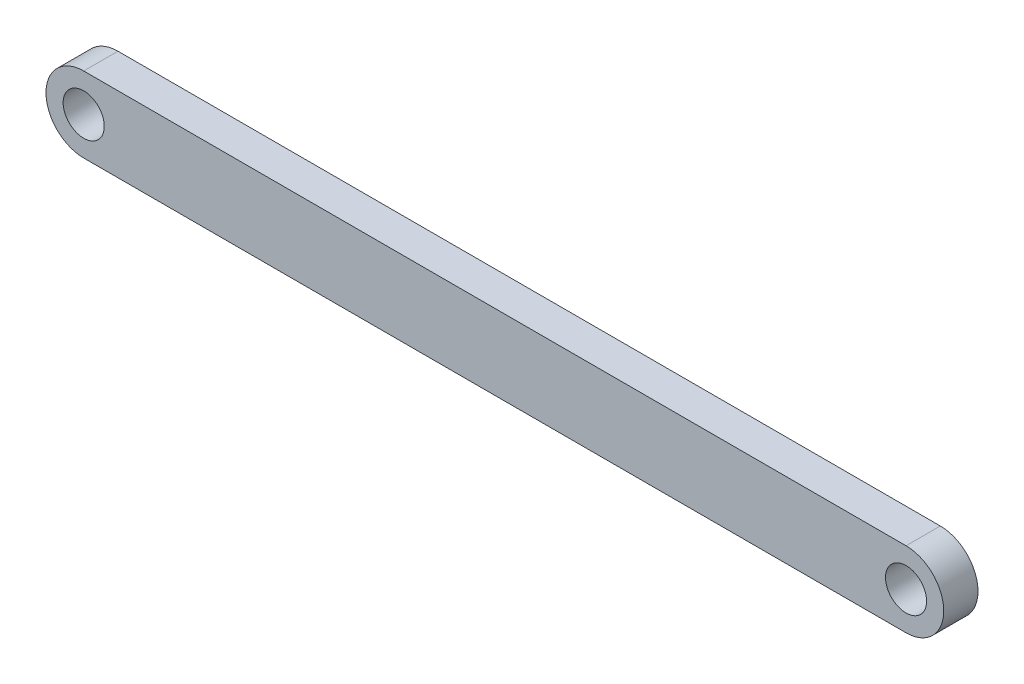
ISO-10303-21;
HEADER;
FILE_DESCRIPTION(('STEP AP214'),'2;1');
FILE_NAME('part.step','',(''),(''),'','','');
FILE_SCHEMA(('AUTOMOTIVE_DESIGN { 1 0 10303 214 1 1 1 1 }'));
ENDSEC;
DATA;
#1=APPLICATION_CONTEXT('core data for automotive mechanical design processes');
#2=APPLICATION_PROTOCOL_DEFINITION('international standard','automotive_design',2000,#1);
#3=PRODUCT_CONTEXT('',#1,'mechanical');
#4=PRODUCT('Part','Part','',(#3));
#5=PRODUCT_RELATED_PRODUCT_CATEGORY('part','',(#4));
#6=PRODUCT_DEFINITION_FORMATION('','',#4);
#7=PRODUCT_DEFINITION_CONTEXT('part definition',#1,'design');
#8=PRODUCT_DEFINITION('design','',#6,#7);
#9=PRODUCT_DEFINITION_SHAPE('','',#8);
#10=(LENGTH_UNIT() NAMED_UNIT(*) SI_UNIT(.MILLI.,.METRE.));
#11=(NAMED_UNIT(*) PLANE_ANGLE_UNIT() SI_UNIT($,.RADIAN.));
#12=(NAMED_UNIT(*) SI_UNIT($,.STERADIAN.) SOLID_ANGLE_UNIT());
#13=UNCERTAINTY_MEASURE_WITH_UNIT(LENGTH_MEASURE(1.E-05),#10,'distance_accuracy_value','');
#14=(GEOMETRIC_REPRESENTATION_CONTEXT(3) GLOBAL_UNCERTAINTY_ASSIGNED_CONTEXT((#13)) GLOBAL_UNIT_ASSIGNED_CONTEXT((#10,
#11,#12)) REPRESENTATION_CONTEXT('',''));
#15=CARTESIAN_POINT('',(0.,0.,0.));
#16=DIRECTION('',(0.,0.,1.));
#17=DIRECTION('',(1.,0.,0.));
#18=AXIS2_PLACEMENT_3D('',#15,#16,#17);
#19=CARTESIAN_POINT('',(-60.,0.,2.5));
#20=DIRECTION('',(0.,0.,1.));
#21=DIRECTION('',(1.,0.,0.));
#22=AXIS2_PLACEMENT_3D('',#19,#20,#21);
#23=PLANE('',#22);
#24=CARTESIAN_POINT('',(-60.,0.,2.5));
#25=DIRECTION('',(0.,0.,1.));
#26=DIRECTION('',(1.,0.,0.));
#27=AXIS2_PLACEMENT_3D('',#24,#25,#26);
#28=CIRCLE('',#27,3.);
#29=CARTESIAN_POINT('',(-57.,0.,2.5));
#30=VERTEX_POINT('',#29);
#31=EDGE_CURVE('E103',#30,#30,#28,.T.);
#32=ORIENTED_EDGE('',*,*,#31,.F.);
#33=EDGE_LOOP('',(#32));
#34=FACE_BOUND('',#33,.T.);
#35=CARTESIAN_POINT('',(-60.,0.,2.5));
#36=DIRECTION('',(0.,0.,1.));
#37=DIRECTION('',(1.,0.,0.));
#38=AXIS2_PLACEMENT_3D('',#35,#36,#37);
#39=CIRCLE('',#38,5.5);
#40=CARTESIAN_POINT('',(-60.,5.5,2.5));
#41=VERTEX_POINT('',#40);
#42=CARTESIAN_POINT('',(-60.,-5.5,2.5));
#43=VERTEX_POINT('',#42);
#44=EDGE_CURVE('E88',#41,#43,#39,.T.);
#45=ORIENTED_EDGE('',*,*,#44,.T.);
#46=DIRECTION('',(1.,0.,0.));
#47=VECTOR('',#46,1.);
#48=CARTESIAN_POINT('',(-60.,-5.5,2.5));
#49=LINE('',#48,#47);
#50=CARTESIAN_POINT('',(60.,-5.5,2.5));
#51=VERTEX_POINT('',#50);
#52=EDGE_CURVE('E83',#43,#51,#49,.T.);
#53=ORIENTED_EDGE('',*,*,#52,.T.);
#54=CARTESIAN_POINT('',(60.,0.,2.5));
#55=DIRECTION('',(0.,0.,1.));
#56=DIRECTION('',(1.,0.,0.));
#57=AXIS2_PLACEMENT_3D('',#54,#55,#56);
#58=CIRCLE('',#57,5.5);
#59=CARTESIAN_POINT('',(60.,5.5,2.5));
#60=VERTEX_POINT('',#59);
#61=EDGE_CURVE('E86',#51,#60,#58,.T.);
#62=ORIENTED_EDGE('',*,*,#61,.T.);
#63=DIRECTION('',(-1.,0.,0.));
#64=VECTOR('',#63,1.);
#65=CARTESIAN_POINT('',(-60.,5.5,2.5));
#66=LINE('',#65,#64);
#67=EDGE_CURVE('E53',#60,#41,#66,.T.);
#68=ORIENTED_EDGE('',*,*,#67,.T.);
#69=EDGE_LOOP('',(#45,#53,#62,#68));
#70=FACE_BOUND('',#69,.T.);
#71=CARTESIAN_POINT('',(60.,0.,2.5));
#72=DIRECTION('',(0.,0.,1.));
#73=DIRECTION('',(1.,0.,0.));
#74=AXIS2_PLACEMENT_3D('',#71,#72,#73);
#75=CIRCLE('',#74,3.00000000000001);
#76=CARTESIAN_POINT('',(63.,0.,2.5));
#77=VERTEX_POINT('',#76);
#78=EDGE_CURVE('E118',#77,#77,#75,.T.);
#79=ORIENTED_EDGE('',*,*,#78,.F.);
#80=EDGE_LOOP('',(#79));
#81=FACE_BOUND('',#80,.T.);
#82=ADVANCED_FACE('F36',(#34,#70,#81),#23,.T.);
#83=CARTESIAN_POINT('',(-60.,0.,-2.5));
#84=DIRECTION('',(0.,0.,1.));
#85=DIRECTION('',(1.,0.,0.));
#86=AXIS2_PLACEMENT_3D('',#83,#84,#85);
#87=PLANE('',#86);
#88=CARTESIAN_POINT('',(-60.,0.,-2.5));
#89=DIRECTION('',(0.,0.,1.));
#90=DIRECTION('',(1.,0.,0.));
#91=AXIS2_PLACEMENT_3D('',#88,#89,#90);
#92=CIRCLE('',#91,5.5);
#93=CARTESIAN_POINT('',(-60.,5.5,-2.5));
#94=VERTEX_POINT('',#93);
#95=CARTESIAN_POINT('',(-60.,-5.5,-2.5));
#96=VERTEX_POINT('',#95);
#97=EDGE_CURVE('E100',#94,#96,#92,.T.);
#98=ORIENTED_EDGE('',*,*,#97,.F.);
#99=DIRECTION('',(-1.,0.,0.));
#100=VECTOR('',#99,1.);
#101=CARTESIAN_POINT('',(-60.,5.5,-2.5));
#102=LINE('',#101,#100);
#103=CARTESIAN_POINT('',(60.,5.5,-2.5));
#104=VERTEX_POINT('',#103);
#105=EDGE_CURVE('E76',#104,#94,#102,.T.);
#106=ORIENTED_EDGE('',*,*,#105,.F.);
#107=CARTESIAN_POINT('',(60.,0.,-2.5));
#108=DIRECTION('',(0.,0.,1.));
#109=DIRECTION('',(1.,0.,0.));
#110=AXIS2_PLACEMENT_3D('',#107,#108,#109);
#111=CIRCLE('',#110,5.5);
#112=CARTESIAN_POINT('',(60.,-5.5,-2.5));
#113=VERTEX_POINT('',#112);
#114=EDGE_CURVE('E70',#113,#104,#111,.T.);
#115=ORIENTED_EDGE('',*,*,#114,.F.);
#116=DIRECTION('',(1.,0.,0.));
#117=VECTOR('',#116,1.);
#118=CARTESIAN_POINT('',(-60.,-5.5,-2.5));
#119=LINE('',#118,#117);
#120=EDGE_CURVE('E92',#96,#113,#119,.T.);
#121=ORIENTED_EDGE('',*,*,#120,.F.);
#122=EDGE_LOOP('',(#98,#106,#115,#121));
#123=FACE_BOUND('',#122,.T.);
#124=CARTESIAN_POINT('',(-60.,0.,-2.5));
#125=DIRECTION('',(0.,0.,1.));
#126=DIRECTION('',(1.,0.,0.));
#127=AXIS2_PLACEMENT_3D('',#124,#125,#126);
#128=CIRCLE('',#127,3.);
#129=CARTESIAN_POINT('',(-57.,0.,-2.5));
#130=VERTEX_POINT('',#129);
#131=EDGE_CURVE('E115',#130,#130,#128,.T.);
#132=ORIENTED_EDGE('',*,*,#131,.T.);
#133=EDGE_LOOP('',(#132));
#134=FACE_BOUND('',#133,.T.);
#135=CARTESIAN_POINT('',(60.,0.,-2.5));
#136=DIRECTION('',(0.,0.,1.));
#137=DIRECTION('',(1.,0.,0.));
#138=AXIS2_PLACEMENT_3D('',#135,#136,#137);
#139=CIRCLE('',#138,3.00000000000001);
#140=CARTESIAN_POINT('',(63.,0.,-2.5));
#141=VERTEX_POINT('',#140);
#142=EDGE_CURVE('E121',#141,#141,#139,.T.);
#143=ORIENTED_EDGE('',*,*,#142,.T.);
#144=EDGE_LOOP('',(#143));
#145=FACE_BOUND('',#144,.T.);
#146=ADVANCED_FACE('F111',(#123,#134,#145),#87,.F.);
#147=CARTESIAN_POINT('',(-60.,0.,2.5));
#148=DIRECTION('',(0.,0.,-1.));
#149=DIRECTION('',(-1.,0.,0.));
#150=AXIS2_PLACEMENT_3D('',#147,#148,#149);
#151=CYLINDRICAL_SURFACE('',#150,5.5);
#152=ORIENTED_EDGE('',*,*,#97,.T.);
#153=DIRECTION('',(0.,0.,-1.));
#154=VECTOR('',#153,1.);
#155=CARTESIAN_POINT('',(-60.,-5.5,2.5));
#156=LINE('',#155,#154);
#157=EDGE_CURVE('E11',#43,#96,#156,.T.);
#158=ORIENTED_EDGE('',*,*,#157,.F.);
#159=ORIENTED_EDGE('',*,*,#44,.F.);
#160=DIRECTION('',(0.,0.,-1.));
#161=VECTOR('',#160,1.);
#162=CARTESIAN_POINT('',(-60.,5.5,2.5));
#163=LINE('',#162,#161);
#164=EDGE_CURVE('E96',#41,#94,#163,.T.);
#165=ORIENTED_EDGE('',*,*,#164,.T.);
#166=EDGE_LOOP('',(#152,#158,#159,#165));
#167=FACE_BOUND('',#166,.T.);
#168=ADVANCED_FACE('F38',(#167),#151,.T.);
#169=CARTESIAN_POINT('',(-60.,-5.5,2.5));
#170=DIRECTION('',(0.,1.,0.));
#171=DIRECTION('',(0.,0.,1.));
#172=AXIS2_PLACEMENT_3D('',#169,#170,#171);
#173=PLANE('',#172);
#174=ORIENTED_EDGE('',*,*,#120,.T.);
#175=DIRECTION('',(0.,0.,-1.));
#176=VECTOR('',#175,1.);
#177=CARTESIAN_POINT('',(60.,-5.5,2.5));
#178=LINE('',#177,#176);
#179=EDGE_CURVE('E45',#51,#113,#178,.T.);
#180=ORIENTED_EDGE('',*,*,#179,.F.);
#181=ORIENTED_EDGE('',*,*,#52,.F.);
#182=ORIENTED_EDGE('',*,*,#157,.T.);
#183=EDGE_LOOP('',(#174,#180,#181,#182));
#184=FACE_BOUND('',#183,.T.);
#185=ADVANCED_FACE('F91',(#184),#173,.F.);
#186=CARTESIAN_POINT('',(60.,0.,2.5));
#187=DIRECTION('',(0.,0.,-1.));
#188=DIRECTION('',(-1.,0.,0.));
#189=AXIS2_PLACEMENT_3D('',#186,#187,#188);
#190=CYLINDRICAL_SURFACE('',#189,5.5);
#191=ORIENTED_EDGE('',*,*,#114,.T.);
#192=DIRECTION('',(0.,0.,-1.));
#193=VECTOR('',#192,1.);
#194=CARTESIAN_POINT('',(60.,5.5,2.5));
#195=LINE('',#194,#193);
#196=EDGE_CURVE('E93',#60,#104,#195,.T.);
#197=ORIENTED_EDGE('',*,*,#196,.F.);
#198=ORIENTED_EDGE('',*,*,#61,.F.);
#199=ORIENTED_EDGE('',*,*,#179,.T.);
#200=EDGE_LOOP('',(#191,#197,#198,#199));
#201=FACE_BOUND('',#200,.T.);
#202=ADVANCED_FACE('F94',(#201),#190,.T.);
#203=CARTESIAN_POINT('',(-60.,5.5,2.5));
#204=DIRECTION('',(0.,-1.,0.));
#205=DIRECTION('',(0.,0.,-1.));
#206=AXIS2_PLACEMENT_3D('',#203,#204,#205);
#207=PLANE('',#206);
#208=ORIENTED_EDGE('',*,*,#105,.T.);
#209=ORIENTED_EDGE('',*,*,#164,.F.);
#210=ORIENTED_EDGE('',*,*,#67,.F.);
#211=ORIENTED_EDGE('',*,*,#196,.T.);
#212=EDGE_LOOP('',(#208,#209,#210,#211));
#213=FACE_BOUND('',#212,.T.);
#214=ADVANCED_FACE('F108',(#213),#207,.F.);
#215=CARTESIAN_POINT('',(-60.,0.,2.5));
#216=DIRECTION('',(0.,0.,-1.));
#217=DIRECTION('',(-1.,0.,0.));
#218=AXIS2_PLACEMENT_3D('',#215,#216,#217);
#219=CYLINDRICAL_SURFACE('',#218,3.);
#220=ORIENTED_EDGE('',*,*,#31,.T.);
#221=EDGE_LOOP('',(#220));
#222=FACE_BOUND('',#221,.T.);
#223=ORIENTED_EDGE('',*,*,#131,.F.);
#224=EDGE_LOOP('',(#223));
#225=FACE_BOUND('',#224,.T.);
#226=ADVANCED_FACE('F138',(#222,#225),#219,.F.);
#227=CARTESIAN_POINT('',(60.,0.,2.5));
#228=DIRECTION('',(0.,0.,-1.));
#229=DIRECTION('',(-1.,0.,0.));
#230=AXIS2_PLACEMENT_3D('',#227,#228,#229);
#231=CYLINDRICAL_SURFACE('',#230,3.00000000000001);
#232=ORIENTED_EDGE('',*,*,#78,.T.);
#233=EDGE_LOOP('',(#232));
#234=FACE_BOUND('',#233,.T.);
#235=ORIENTED_EDGE('',*,*,#142,.F.);
#236=EDGE_LOOP('',(#235));
#237=FACE_BOUND('',#236,.T.);
#238=ADVANCED_FACE('F127',(#234,#237),#231,.F.);
#239=CLOSED_SHELL('',(#82,#146,#168,#185,#202,#214,#226,#238));
#240=MANIFOLD_SOLID_BREP('B2',#239);
#241=ADVANCED_BREP_SHAPE_REPRESENTATION('',(#18,#240),#14);
#242=SHAPE_DEFINITION_REPRESENTATION(#9,#241);
ENDSEC;
END-ISO-10303-21;
